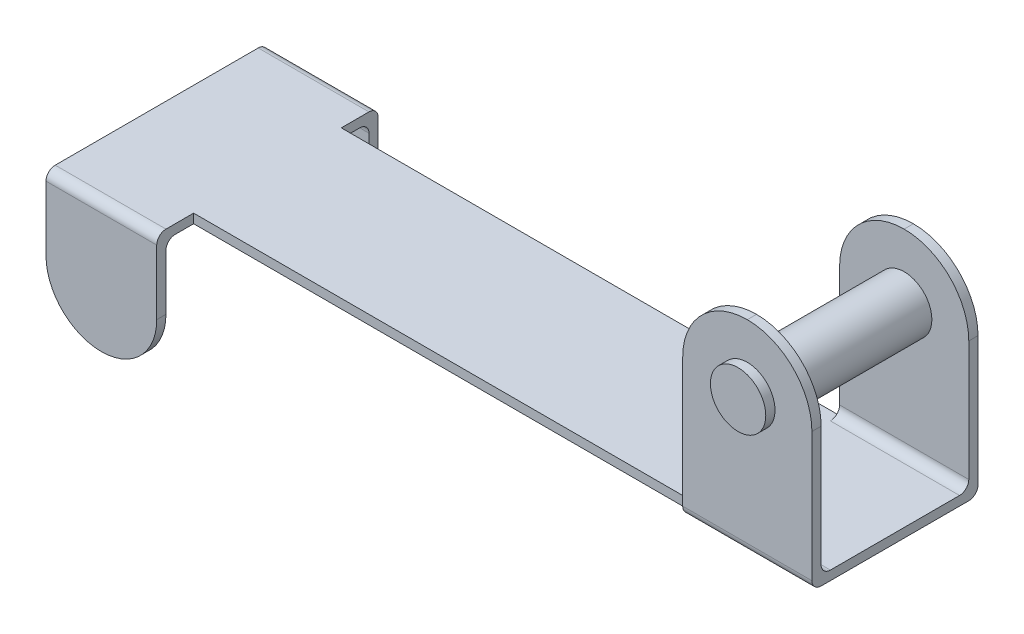
ISO-10303-21;
HEADER;
FILE_DESCRIPTION(('STEP AP214'),'2;1');
FILE_NAME('part.step','',(''),(''),'','','');
FILE_SCHEMA(('AUTOMOTIVE_DESIGN { 1 0 10303 214 1 1 1 1 }'));
ENDSEC;
DATA;
#1=APPLICATION_CONTEXT('core data for automotive mechanical design processes');
#2=APPLICATION_PROTOCOL_DEFINITION('international standard','automotive_design',2000,#1);
#3=PRODUCT_CONTEXT('',#1,'mechanical');
#4=PRODUCT('Part','Part','',(#3));
#5=PRODUCT_RELATED_PRODUCT_CATEGORY('part','',(#4));
#6=PRODUCT_DEFINITION_FORMATION('','',#4);
#7=PRODUCT_DEFINITION_CONTEXT('part definition',#1,'design');
#8=PRODUCT_DEFINITION('design','',#6,#7);
#9=PRODUCT_DEFINITION_SHAPE('','',#8);
#10=(LENGTH_UNIT() NAMED_UNIT(*) SI_UNIT(.MILLI.,.METRE.));
#11=(NAMED_UNIT(*) PLANE_ANGLE_UNIT() SI_UNIT($,.RADIAN.));
#12=(NAMED_UNIT(*) SI_UNIT($,.STERADIAN.) SOLID_ANGLE_UNIT());
#13=UNCERTAINTY_MEASURE_WITH_UNIT(LENGTH_MEASURE(1.E-05),#10,'distance_accuracy_value','');
#14=(GEOMETRIC_REPRESENTATION_CONTEXT(3) GLOBAL_UNCERTAINTY_ASSIGNED_CONTEXT((#13)) GLOBAL_UNIT_ASSIGNED_CONTEXT((#10,
#11,#12)) REPRESENTATION_CONTEXT('',''));
#15=CARTESIAN_POINT('',(0.,0.,0.));
#16=DIRECTION('',(0.,0.,1.));
#17=DIRECTION('',(1.,0.,0.));
#18=AXIS2_PLACEMENT_3D('',#15,#16,#17);
#19=CARTESIAN_POINT('',(0.,0.,2.));
#20=DIRECTION('',(0.,0.,1.));
#21=DIRECTION('',(1.,0.,0.));
#22=AXIS2_PLACEMENT_3D('',#19,#20,#21);
#23=PLANE('',#22);
#24=DIRECTION('',(-1.,0.,0.));
#25=VECTOR('',#24,1.);
#26=CARTESIAN_POINT('',(10.,0.125000000000001,2.));
#27=LINE('',#26,#25);
#28=CARTESIAN_POINT('',(6.5,0.125000000000001,2.));
#29=VERTEX_POINT('',#28);
#30=CARTESIAN_POINT('',(-7.,0.124999999999999,2.));
#31=VERTEX_POINT('',#30);
#32=EDGE_CURVE('E264',#29,#31,#27,.T.);
#33=ORIENTED_EDGE('',*,*,#32,.T.);
#34=DIRECTION('',(0.,-1.,0.));
#35=VECTOR('',#34,1.);
#36=CARTESIAN_POINT('',(-7.,0.124999999999999,2.));
#37=LINE('',#36,#35);
#38=CARTESIAN_POINT('',(-7.,-0.125000000000001,2.));
#39=VERTEX_POINT('',#38);
#40=EDGE_CURVE('E492',#31,#39,#37,.T.);
#41=ORIENTED_EDGE('',*,*,#40,.T.);
#42=DIRECTION('',(1.,0.,0.));
#43=VECTOR('',#42,1.);
#44=CARTESIAN_POINT('',(10.,-0.124999999999999,2.));
#45=LINE('',#44,#43);
#46=CARTESIAN_POINT('',(6.5,-0.124999999999999,2.));
#47=VERTEX_POINT('',#46);
#48=EDGE_CURVE('E262',#39,#47,#45,.T.);
#49=ORIENTED_EDGE('',*,*,#48,.T.);
#50=DIRECTION('',(0.,1.,0.));
#51=VECTOR('',#50,1.);
#52=CARTESIAN_POINT('',(6.5,-0.124999999999999,2.));
#53=LINE('',#52,#51);
#54=EDGE_CURVE('E480',#47,#29,#53,.T.);
#55=ORIENTED_EDGE('',*,*,#54,.T.);
#56=EDGE_LOOP('',(#33,#41,#49,#55));
#57=FACE_BOUND('',#56,.T.);
#58=ADVANCED_FACE('F32',(#57),#23,.T.);
#59=CARTESIAN_POINT('',(-10.,-0.125000000000001,2.));
#60=DIRECTION('',(1.,0.,0.));
#61=DIRECTION('',(0.,0.,-1.));
#62=AXIS2_PLACEMENT_3D('',#59,#60,#61);
#63=PLANE('',#62);
#64=DIRECTION('',(0.,1.,0.));
#65=VECTOR('',#64,1.);
#66=CARTESIAN_POINT('',(-10.,-3.375,3.));
#67=LINE('',#66,#65);
#68=CARTESIAN_POINT('',(-10.,-1.875,3.));
#69=VERTEX_POINT('',#68);
#70=CARTESIAN_POINT('',(-10.,-0.125000000000001,3.));
#71=VERTEX_POINT('',#70);
#72=EDGE_CURVE('E399',#69,#71,#67,.T.);
#73=ORIENTED_EDGE('',*,*,#72,.T.);
#74=CARTESIAN_POINT('',(-10.,-0.125000000000001,2.75));
#75=DIRECTION('',(1.,0.,0.));
#76=DIRECTION('',(0.,0.,-1.));
#77=AXIS2_PLACEMENT_3D('',#74,#75,#76);
#78=CIRCLE('',#77,0.25);
#79=CARTESIAN_POINT('',(-10.,0.124999999999999,2.75));
#80=VERTEX_POINT('',#79);
#81=EDGE_CURVE('E407',#71,#80,#78,.F.);
#82=ORIENTED_EDGE('',*,*,#81,.T.);
#83=DIRECTION('',(0.,0.,-1.));
#84=VECTOR('',#83,1.);
#85=CARTESIAN_POINT('',(-10.,0.124999999999999,2.));
#86=LINE('',#85,#84);
#87=CARTESIAN_POINT('',(-10.,0.124999999999999,-2.75));
#88=VERTEX_POINT('',#87);
#89=EDGE_CURVE('E270',#80,#88,#86,.T.);
#90=ORIENTED_EDGE('',*,*,#89,.T.);
#91=CARTESIAN_POINT('',(-10.,-0.125000000000001,-2.75));
#92=DIRECTION('',(1.,0.,0.));
#93=DIRECTION('',(0.,0.,-1.));
#94=AXIS2_PLACEMENT_3D('',#91,#92,#93);
#95=CIRCLE('',#94,0.25);
#96=CARTESIAN_POINT('',(-10.,-0.125000000000001,-3.));
#97=VERTEX_POINT('',#96);
#98=EDGE_CURVE('E405',#88,#97,#95,.F.);
#99=ORIENTED_EDGE('',*,*,#98,.T.);
#100=DIRECTION('',(0.,-1.,0.));
#101=VECTOR('',#100,1.);
#102=CARTESIAN_POINT('',(-10.,-3.375,-3.));
#103=LINE('',#102,#101);
#104=CARTESIAN_POINT('',(-10.,-1.875,-3.));
#105=VERTEX_POINT('',#104);
#106=EDGE_CURVE('E455',#97,#105,#103,.T.);
#107=ORIENTED_EDGE('',*,*,#106,.T.);
#108=DIRECTION('',(0.,0.,1.));
#109=VECTOR('',#108,1.);
#110=CARTESIAN_POINT('',(-10.,-1.875,-2.75));
#111=LINE('',#110,#109);
#112=CARTESIAN_POINT('',(-10.,-1.875,-2.75));
#113=VERTEX_POINT('',#112);
#114=EDGE_CURVE('E353',#105,#113,#111,.T.);
#115=ORIENTED_EDGE('',*,*,#114,.T.);
#116=DIRECTION('',(0.,1.,0.));
#117=VECTOR('',#116,1.);
#118=CARTESIAN_POINT('',(-10.,-0.124999999999999,-2.75));
#119=LINE('',#118,#117);
#120=CARTESIAN_POINT('',(-10.,-0.375000000000001,-2.75));
#121=VERTEX_POINT('',#120);
#122=EDGE_CURVE('E254',#113,#121,#119,.T.);
#123=ORIENTED_EDGE('',*,*,#122,.T.);
#124=CARTESIAN_POINT('',(-10.,-0.375000000000001,-2.5));
#125=DIRECTION('',(1.,0.,0.));
#126=DIRECTION('',(0.,0.,-1.));
#127=AXIS2_PLACEMENT_3D('',#124,#125,#126);
#128=CIRCLE('',#127,0.25);
#129=CARTESIAN_POINT('',(-10.,-0.125000000000001,-2.5));
#130=VERTEX_POINT('',#129);
#131=EDGE_CURVE('E40',#121,#130,#128,.T.);
#132=ORIENTED_EDGE('',*,*,#131,.T.);
#133=DIRECTION('',(0.,0.,-1.));
#134=VECTOR('',#133,1.);
#135=CARTESIAN_POINT('',(-10.,-0.125000000000001,2.));
#136=LINE('',#135,#134);
#137=CARTESIAN_POINT('',(-10.,-0.125000000000001,2.5));
#138=VERTEX_POINT('',#137);
#139=EDGE_CURVE('E279',#138,#130,#136,.T.);
#140=ORIENTED_EDGE('',*,*,#139,.F.);
#141=CARTESIAN_POINT('',(-10.,-0.375000000000001,2.5));
#142=DIRECTION('',(1.,0.,0.));
#143=DIRECTION('',(0.,0.,-1.));
#144=AXIS2_PLACEMENT_3D('',#141,#142,#143);
#145=CIRCLE('',#144,0.25);
#146=CARTESIAN_POINT('',(-10.,-0.375000000000001,2.75));
#147=VERTEX_POINT('',#146);
#148=EDGE_CURVE('E427',#138,#147,#145,.T.);
#149=ORIENTED_EDGE('',*,*,#148,.T.);
#150=DIRECTION('',(0.,-1.,0.));
#151=VECTOR('',#150,1.);
#152=CARTESIAN_POINT('',(-10.,-0.124999999999999,2.75));
#153=LINE('',#152,#151);
#154=CARTESIAN_POINT('',(-10.,-1.875,2.75));
#155=VERTEX_POINT('',#154);
#156=EDGE_CURVE('E510',#147,#155,#153,.T.);
#157=ORIENTED_EDGE('',*,*,#156,.T.);
#158=DIRECTION('',(0.,0.,1.));
#159=VECTOR('',#158,1.);
#160=CARTESIAN_POINT('',(-10.,-1.875,3.));
#161=LINE('',#160,#159);
#162=EDGE_CURVE('E368',#155,#69,#161,.T.);
#163=ORIENTED_EDGE('',*,*,#162,.T.);
#164=EDGE_LOOP('',(#73,#82,#90,#99,#107,#115,#123,#132,#140,#149,#157,#163));
#165=FACE_BOUND('',#164,.T.);
#166=ADVANCED_FACE('F434',(#165),#63,.F.);
#167=CARTESIAN_POINT('',(10.,-0.124999999999999,2.));
#168=DIRECTION('',(0.,1.,0.));
#169=DIRECTION('',(-1.,0.,0.));
#170=AXIS2_PLACEMENT_3D('',#167,#168,#169);
#171=PLANE('',#170);
#172=DIRECTION('',(0.,0.,1.));
#173=VECTOR('',#172,1.);
#174=CARTESIAN_POINT('',(-7.,-0.124999999999999,2.));
#175=LINE('',#174,#173);
#176=CARTESIAN_POINT('',(-7.,-0.124999999999999,2.5));
#177=VERTEX_POINT('',#176);
#178=EDGE_CURVE('E501',#39,#177,#175,.T.);
#179=ORIENTED_EDGE('',*,*,#178,.T.);
#180=DIRECTION('',(-1.,0.,0.));
#181=VECTOR('',#180,1.);
#182=CARTESIAN_POINT('',(10.,-0.124999999999999,2.5));
#183=LINE('',#182,#181);
#184=EDGE_CURVE('E417',#177,#138,#183,.T.);
#185=ORIENTED_EDGE('',*,*,#184,.T.);
#186=ORIENTED_EDGE('',*,*,#139,.T.);
#187=DIRECTION('',(-1.,0.,0.));
#188=VECTOR('',#187,1.);
#189=CARTESIAN_POINT('',(10.,-0.124999999999999,-2.5));
#190=LINE('',#189,#188);
#191=CARTESIAN_POINT('',(-7.,-0.124999999999999,-2.5));
#192=VERTEX_POINT('',#191);
#193=EDGE_CURVE('E415',#130,#192,#190,.F.);
#194=ORIENTED_EDGE('',*,*,#193,.T.);
#195=DIRECTION('',(0.,0.,1.));
#196=VECTOR('',#195,1.);
#197=CARTESIAN_POINT('',(-7.,-0.124999999999999,-2.));
#198=LINE('',#197,#196);
#199=CARTESIAN_POINT('',(-7.,-0.124999999999999,-2.));
#200=VERTEX_POINT('',#199);
#201=EDGE_CURVE('E449',#192,#200,#198,.T.);
#202=ORIENTED_EDGE('',*,*,#201,.T.);
#203=DIRECTION('',(1.,0.,0.));
#204=VECTOR('',#203,1.);
#205=CARTESIAN_POINT('',(10.,-0.124999999999999,-2.));
#206=LINE('',#205,#204);
#207=CARTESIAN_POINT('',(6.5,-0.124999999999999,-2.));
#208=VERTEX_POINT('',#207);
#209=EDGE_CURVE('E253',#200,#208,#206,.T.);
#210=ORIENTED_EDGE('',*,*,#209,.T.);
#211=DIRECTION('',(1.,0.,0.));
#212=VECTOR('',#211,1.);
#213=CARTESIAN_POINT('',(10.,-0.124999999999999,-2.));
#214=LINE('',#213,#212);
#215=CARTESIAN_POINT('',(10.,-0.124999999999999,-2.));
#216=VERTEX_POINT('',#215);
#217=EDGE_CURVE('E286',#208,#216,#214,.T.);
#218=ORIENTED_EDGE('',*,*,#217,.T.);
#219=DIRECTION('',(0.,0.,-1.));
#220=VECTOR('',#219,1.);
#221=CARTESIAN_POINT('',(10.,-0.124999999999999,2.));
#222=LINE('',#221,#220);
#223=CARTESIAN_POINT('',(10.,-0.124999999999999,2.));
#224=VERTEX_POINT('',#223);
#225=EDGE_CURVE('E276',#224,#216,#222,.T.);
#226=ORIENTED_EDGE('',*,*,#225,.F.);
#227=DIRECTION('',(1.,0.,0.));
#228=VECTOR('',#227,1.);
#229=CARTESIAN_POINT('',(6.5,-0.124999999999999,2.));
#230=LINE('',#229,#228);
#231=EDGE_CURVE('E283',#224,#47,#230,.F.);
#232=ORIENTED_EDGE('',*,*,#231,.T.);
#233=ORIENTED_EDGE('',*,*,#48,.F.);
#234=EDGE_LOOP('',(#179,#185,#186,#194,#202,#210,#218,#226,#232,#233));
#235=FACE_BOUND('',#234,.T.);
#236=ADVANCED_FACE('F441',(#235),#171,.F.);
#237=CARTESIAN_POINT('',(10.,-0.124999999999999,2.));
#238=DIRECTION('',(-1.,0.,0.));
#239=DIRECTION('',(0.,0.,1.));
#240=AXIS2_PLACEMENT_3D('',#237,#238,#239);
#241=PLANE('',#240);
#242=DIRECTION('',(0.,1.,0.));
#243=VECTOR('',#242,1.);
#244=CARTESIAN_POINT('',(10.,-0.124999999999998,-2.25));
#245=LINE('',#244,#243);
#246=CARTESIAN_POINT('',(10.,0.125000000000001,-2.25));
#247=VERTEX_POINT('',#246);
#248=CARTESIAN_POINT('',(10.,3.625,-2.25));
#249=VERTEX_POINT('',#248);
#250=EDGE_CURVE('E473',#247,#249,#245,.T.);
#251=ORIENTED_EDGE('',*,*,#250,.T.);
#252=DIRECTION('',(0.,0.,1.));
#253=VECTOR('',#252,1.);
#254=CARTESIAN_POINT('',(10.,3.625,-2.));
#255=LINE('',#254,#253);
#256=CARTESIAN_POINT('',(10.,3.625,-2.));
#257=VERTEX_POINT('',#256);
#258=EDGE_CURVE('E329',#249,#257,#255,.T.);
#259=ORIENTED_EDGE('',*,*,#258,.T.);
#260=DIRECTION('',(0.,-1.,0.));
#261=VECTOR('',#260,1.);
#262=CARTESIAN_POINT('',(10.,-0.124999999999999,-2.));
#263=LINE('',#262,#261);
#264=CARTESIAN_POINT('',(10.,0.375000000000001,-2.));
#265=VERTEX_POINT('',#264);
#266=EDGE_CURVE('E357',#257,#265,#263,.T.);
#267=ORIENTED_EDGE('',*,*,#266,.T.);
#268=CARTESIAN_POINT('',(10.,0.375000000000001,-1.75));
#269=DIRECTION('',(-1.,0.,0.));
#270=DIRECTION('',(0.,0.,1.));
#271=AXIS2_PLACEMENT_3D('',#268,#269,#270);
#272=CIRCLE('',#271,0.25);
#273=CARTESIAN_POINT('',(10.,0.125000000000001,-1.75));
#274=VERTEX_POINT('',#273);
#275=EDGE_CURVE('E321',#265,#274,#272,.T.);
#276=ORIENTED_EDGE('',*,*,#275,.T.);
#277=DIRECTION('',(0.,0.,-1.));
#278=VECTOR('',#277,1.);
#279=CARTESIAN_POINT('',(10.,0.125000000000001,2.));
#280=LINE('',#279,#278);
#281=CARTESIAN_POINT('',(10.,0.125000000000001,1.75));
#282=VERTEX_POINT('',#281);
#283=EDGE_CURVE('E273',#282,#274,#280,.T.);
#284=ORIENTED_EDGE('',*,*,#283,.F.);
#285=CARTESIAN_POINT('',(10.,0.375000000000001,1.75));
#286=DIRECTION('',(-1.,0.,0.));
#287=DIRECTION('',(0.,0.,1.));
#288=AXIS2_PLACEMENT_3D('',#285,#286,#287);
#289=CIRCLE('',#288,0.25);
#290=CARTESIAN_POINT('',(10.,0.375000000000001,2.));
#291=VERTEX_POINT('',#290);
#292=EDGE_CURVE('E325',#282,#291,#289,.T.);
#293=ORIENTED_EDGE('',*,*,#292,.T.);
#294=DIRECTION('',(0.,1.,0.));
#295=VECTOR('',#294,1.);
#296=CARTESIAN_POINT('',(10.,-0.124999999999999,2.));
#297=LINE('',#296,#295);
#298=CARTESIAN_POINT('',(10.,3.625,2.));
#299=VERTEX_POINT('',#298);
#300=EDGE_CURVE('E476',#291,#299,#297,.T.);
#301=ORIENTED_EDGE('',*,*,#300,.T.);
#302=DIRECTION('',(0.,0.,1.));
#303=VECTOR('',#302,1.);
#304=CARTESIAN_POINT('',(10.,3.625,2.25));
#305=LINE('',#304,#303);
#306=CARTESIAN_POINT('',(10.,3.625,2.25));
#307=VERTEX_POINT('',#306);
#308=EDGE_CURVE('E327',#299,#307,#305,.T.);
#309=ORIENTED_EDGE('',*,*,#308,.T.);
#310=DIRECTION('',(0.,-1.,0.));
#311=VECTOR('',#310,1.);
#312=CARTESIAN_POINT('',(10.,-0.124999999999999,2.25));
#313=LINE('',#312,#311);
#314=CARTESIAN_POINT('',(10.,0.125000000000001,2.25));
#315=VERTEX_POINT('',#314);
#316=EDGE_CURVE('E487',#307,#315,#313,.T.);
#317=ORIENTED_EDGE('',*,*,#316,.T.);
#318=CARTESIAN_POINT('',(10.,0.125000000000001,2.));
#319=DIRECTION('',(-1.,0.,0.));
#320=DIRECTION('',(0.,0.,1.));
#321=AXIS2_PLACEMENT_3D('',#318,#319,#320);
#322=CIRCLE('',#321,0.25);
#323=EDGE_CURVE('E289',#315,#224,#322,.F.);
#324=ORIENTED_EDGE('',*,*,#323,.T.);
#325=ORIENTED_EDGE('',*,*,#225,.T.);
#326=CARTESIAN_POINT('',(10.,0.125000000000001,-2.));
#327=DIRECTION('',(-1.,0.,0.));
#328=DIRECTION('',(0.,0.,1.));
#329=AXIS2_PLACEMENT_3D('',#326,#327,#328);
#330=CIRCLE('',#329,0.25);
#331=EDGE_CURVE('E291',#216,#247,#330,.F.);
#332=ORIENTED_EDGE('',*,*,#331,.T.);
#333=EDGE_LOOP('',(#251,#259,#267,#276,#284,#293,#301,#309,#317,#324,#325,#332));
#334=FACE_BOUND('',#333,.T.);
#335=ADVANCED_FACE('F559',(#334),#241,.F.);
#336=CARTESIAN_POINT('',(10.,0.125000000000001,2.));
#337=DIRECTION('',(0.,-1.,0.));
#338=DIRECTION('',(1.,0.,0.));
#339=AXIS2_PLACEMENT_3D('',#336,#337,#338);
#340=PLANE('',#339);
#341=ORIENTED_EDGE('',*,*,#89,.F.);
#342=DIRECTION('',(-1.,0.,0.));
#343=VECTOR('',#342,1.);
#344=CARTESIAN_POINT('',(-7.,0.124999999999999,2.75));
#345=LINE('',#344,#343);
#346=CARTESIAN_POINT('',(-7.,0.124999999999999,2.75));
#347=VERTEX_POINT('',#346);
#348=EDGE_CURVE('E411',#80,#347,#345,.F.);
#349=ORIENTED_EDGE('',*,*,#348,.T.);
#350=DIRECTION('',(0.,0.,-1.));
#351=VECTOR('',#350,1.);
#352=CARTESIAN_POINT('',(-7.,0.124999999999999,3.));
#353=LINE('',#352,#351);
#354=EDGE_CURVE('E499',#347,#31,#353,.T.);
#355=ORIENTED_EDGE('',*,*,#354,.T.);
#356=ORIENTED_EDGE('',*,*,#32,.F.);
#357=DIRECTION('',(0.,0.,-1.));
#358=VECTOR('',#357,1.);
#359=CARTESIAN_POINT('',(6.5,0.125000000000001,0.));
#360=LINE('',#359,#358);
#361=CARTESIAN_POINT('',(6.5,0.125000000000001,1.75));
#362=VERTEX_POINT('',#361);
#363=EDGE_CURVE('E306',#29,#362,#360,.T.);
#364=ORIENTED_EDGE('',*,*,#363,.T.);
#365=DIRECTION('',(-1.,0.,0.));
#366=VECTOR('',#365,1.);
#367=CARTESIAN_POINT('',(10.,0.125000000000001,1.75));
#368=LINE('',#367,#366);
#369=EDGE_CURVE('E304',#362,#282,#368,.F.);
#370=ORIENTED_EDGE('',*,*,#369,.T.);
#371=ORIENTED_EDGE('',*,*,#283,.T.);
#372=DIRECTION('',(-1.,0.,0.));
#373=VECTOR('',#372,1.);
#374=CARTESIAN_POINT('',(10.,0.125000000000001,-1.75));
#375=LINE('',#374,#373);
#376=CARTESIAN_POINT('',(6.5,0.125000000000001,-1.75));
#377=VERTEX_POINT('',#376);
#378=EDGE_CURVE('E310',#274,#377,#375,.T.);
#379=ORIENTED_EDGE('',*,*,#378,.T.);
#380=DIRECTION('',(0.,0.,-1.));
#381=VECTOR('',#380,1.);
#382=CARTESIAN_POINT('',(6.5,0.125000000000001,2.));
#383=LINE('',#382,#381);
#384=CARTESIAN_POINT('',(6.5,0.125,-2.));
#385=VERTEX_POINT('',#384);
#386=EDGE_CURVE('E260',#377,#385,#383,.T.);
#387=ORIENTED_EDGE('',*,*,#386,.T.);
#388=DIRECTION('',(-1.,0.,0.));
#389=VECTOR('',#388,1.);
#390=CARTESIAN_POINT('',(10.,0.125000000000001,-2.));
#391=LINE('',#390,#389);
#392=CARTESIAN_POINT('',(-7.,0.124999999999999,-2.));
#393=VERTEX_POINT('',#392);
#394=EDGE_CURVE('E252',#385,#393,#391,.T.);
#395=ORIENTED_EDGE('',*,*,#394,.T.);
#396=DIRECTION('',(0.,0.,-1.));
#397=VECTOR('',#396,1.);
#398=CARTESIAN_POINT('',(-7.,0.124999999999999,-3.));
#399=LINE('',#398,#397);
#400=CARTESIAN_POINT('',(-7.,0.124999999999999,-2.75));
#401=VERTEX_POINT('',#400);
#402=EDGE_CURVE('E235',#393,#401,#399,.T.);
#403=ORIENTED_EDGE('',*,*,#402,.T.);
#404=DIRECTION('',(-1.,0.,0.));
#405=VECTOR('',#404,1.);
#406=CARTESIAN_POINT('',(-10.,0.124999999999999,-2.75));
#407=LINE('',#406,#405);
#408=EDGE_CURVE('E409',#401,#88,#407,.T.);
#409=ORIENTED_EDGE('',*,*,#408,.T.);
#410=EDGE_LOOP('',(#341,#349,#355,#356,#364,#370,#371,#379,#387,#395,#403,#409));
#411=FACE_BOUND('',#410,.T.);
#412=ADVANCED_FACE('F257',(#411),#340,.F.);
#413=CARTESIAN_POINT('',(0.,0.,-2.));
#414=DIRECTION('',(0.,0.,1.));
#415=DIRECTION('',(1.,0.,0.));
#416=AXIS2_PLACEMENT_3D('',#413,#414,#415);
#417=PLANE('',#416);
#418=ORIENTED_EDGE('',*,*,#209,.F.);
#419=DIRECTION('',(0.,1.,0.));
#420=VECTOR('',#419,1.);
#421=CARTESIAN_POINT('',(-7.,0.124999999999999,-2.));
#422=LINE('',#421,#420);
#423=EDGE_CURVE('E238',#200,#393,#422,.T.);
#424=ORIENTED_EDGE('',*,*,#423,.T.);
#425=ORIENTED_EDGE('',*,*,#394,.F.);
#426=DIRECTION('',(0.,-1.,0.));
#427=VECTOR('',#426,1.);
#428=CARTESIAN_POINT('',(6.5,-0.124999999999999,-2.));
#429=LINE('',#428,#427);
#430=EDGE_CURVE('E282',#385,#208,#429,.T.);
#431=ORIENTED_EDGE('',*,*,#430,.T.);
#432=EDGE_LOOP('',(#418,#424,#425,#431));
#433=FACE_BOUND('',#432,.T.);
#434=ADVANCED_FACE('F250',(#433),#417,.F.);
#435=CARTESIAN_POINT('',(6.5,-0.124999999999999,2.));
#436=DIRECTION('',(0.,0.,-1.));
#437=DIRECTION('',(-1.,0.,0.));
#438=AXIS2_PLACEMENT_3D('',#435,#436,#437);
#439=PLANE('',#438);
#440=CARTESIAN_POINT('',(8.25,3.625,2.));
#441=DIRECTION('',(0.,0.,-1.));
#442=DIRECTION('',(-1.,0.,0.));
#443=AXIS2_PLACEMENT_3D('',#440,#441,#442);
#444=CIRCLE('',#443,0.75);
#445=CARTESIAN_POINT('',(7.5,3.625,2.));
#446=VERTEX_POINT('',#445);
#447=EDGE_CURVE('E361',#446,#446,#444,.F.);
#448=ORIENTED_EDGE('',*,*,#447,.T.);
#449=EDGE_LOOP('',(#448));
#450=FACE_BOUND('',#449,.T.);
#451=CARTESIAN_POINT('',(6.5,0.375000000000001,2.));
#452=VERTEX_POINT('',#451);
#453=CARTESIAN_POINT('',(6.5,3.625,2.));
#454=VERTEX_POINT('',#453);
#455=EDGE_CURVE('E483',#452,#454,#53,.T.);
#456=ORIENTED_EDGE('',*,*,#455,.T.);
#457=CARTESIAN_POINT('',(8.25,3.625,2.));
#458=DIRECTION('',(0.,0.,-1.));
#459=DIRECTION('',(-1.,0.,0.));
#460=AXIS2_PLACEMENT_3D('',#457,#458,#459);
#461=CIRCLE('',#460,1.75);
#462=CARTESIAN_POINT('',(8.25,5.375,2.));
#463=VERTEX_POINT('',#462);
#464=EDGE_CURVE('E351',#454,#463,#461,.T.);
#465=ORIENTED_EDGE('',*,*,#464,.T.);
#466=CARTESIAN_POINT('',(8.25,3.625,2.));
#467=DIRECTION('',(0.,0.,-1.));
#468=DIRECTION('',(-1.,0.,0.));
#469=AXIS2_PLACEMENT_3D('',#466,#467,#468);
#470=CIRCLE('',#469,1.75);
#471=EDGE_CURVE('E349',#463,#299,#470,.T.);
#472=ORIENTED_EDGE('',*,*,#471,.T.);
#473=ORIENTED_EDGE('',*,*,#300,.F.);
#474=DIRECTION('',(-1.,0.,0.));
#475=VECTOR('',#474,1.);
#476=CARTESIAN_POINT('',(6.5,0.375000000000001,2.));
#477=LINE('',#476,#475);
#478=EDGE_CURVE('E315',#291,#452,#477,.T.);
#479=ORIENTED_EDGE('',*,*,#478,.T.);
#480=EDGE_LOOP('',(#456,#465,#472,#473,#479));
#481=FACE_BOUND('',#480,.T.);
#482=ADVANCED_FACE('F553',(#450,#481),#439,.T.);
#483=CARTESIAN_POINT('',(6.5,-0.124999999999999,2.25));
#484=DIRECTION('',(0.,0.,1.));
#485=DIRECTION('',(1.,0.,0.));
#486=AXIS2_PLACEMENT_3D('',#483,#484,#485);
#487=PLANE('',#486);
#488=CARTESIAN_POINT('',(8.25,3.625,2.25));
#489=DIRECTION('',(0.,0.,1.));
#490=DIRECTION('',(1.,0.,0.));
#491=AXIS2_PLACEMENT_3D('',#488,#489,#490);
#492=CIRCLE('',#491,0.75);
#493=CARTESIAN_POINT('',(9.,3.625,2.25));
#494=VERTEX_POINT('',#493);
#495=EDGE_CURVE('E465',#494,#494,#492,.F.);
#496=ORIENTED_EDGE('',*,*,#495,.T.);
#497=EDGE_LOOP('',(#496));
#498=FACE_BOUND('',#497,.T.);
#499=CARTESIAN_POINT('',(8.25,3.625,2.25));
#500=DIRECTION('',(0.,0.,1.));
#501=DIRECTION('',(1.,0.,0.));
#502=AXIS2_PLACEMENT_3D('',#499,#500,#501);
#503=CIRCLE('',#502,1.75);
#504=CARTESIAN_POINT('',(8.25,5.375,2.25));
#505=VERTEX_POINT('',#504);
#506=EDGE_CURVE('E342',#307,#505,#503,.T.);
#507=ORIENTED_EDGE('',*,*,#506,.T.);
#508=CARTESIAN_POINT('',(8.25,3.625,2.25));
#509=DIRECTION('',(0.,0.,1.));
#510=DIRECTION('',(1.,0.,0.));
#511=AXIS2_PLACEMENT_3D('',#508,#509,#510);
#512=CIRCLE('',#511,1.75);
#513=CARTESIAN_POINT('',(6.5,3.625,2.25));
#514=VERTEX_POINT('',#513);
#515=EDGE_CURVE('E344',#505,#514,#512,.T.);
#516=ORIENTED_EDGE('',*,*,#515,.T.);
#517=DIRECTION('',(0.,-1.,0.));
#518=VECTOR('',#517,1.);
#519=CARTESIAN_POINT('',(6.5,-0.124999999999999,2.25));
#520=LINE('',#519,#518);
#521=CARTESIAN_POINT('',(6.5,0.125000000000001,2.25));
#522=VERTEX_POINT('',#521);
#523=EDGE_CURVE('E266',#514,#522,#520,.T.);
#524=ORIENTED_EDGE('',*,*,#523,.T.);
#525=DIRECTION('',(1.,0.,0.));
#526=VECTOR('',#525,1.);
#527=CARTESIAN_POINT('',(10.,0.125000000000001,2.25));
#528=LINE('',#527,#526);
#529=EDGE_CURVE('E298',#522,#315,#528,.T.);
#530=ORIENTED_EDGE('',*,*,#529,.T.);
#531=ORIENTED_EDGE('',*,*,#316,.F.);
#532=EDGE_LOOP('',(#507,#516,#524,#530,#531));
#533=FACE_BOUND('',#532,.T.);
#534=ADVANCED_FACE('F820',(#498,#533),#487,.T.);
#535=CARTESIAN_POINT('',(6.5,0.,0.));
#536=DIRECTION('',(1.,0.,0.));
#537=DIRECTION('',(0.,0.,-1.));
#538=AXIS2_PLACEMENT_3D('',#535,#536,#537);
#539=PLANE('',#538);
#540=ORIENTED_EDGE('',*,*,#523,.F.);
#541=DIRECTION('',(0.,0.,1.));
#542=VECTOR('',#541,1.);
#543=CARTESIAN_POINT('',(6.5,3.625,2.));
#544=LINE('',#543,#542);
#545=EDGE_CURVE('E346',#514,#454,#544,.F.);
#546=ORIENTED_EDGE('',*,*,#545,.T.);
#547=ORIENTED_EDGE('',*,*,#455,.F.);
#548=CARTESIAN_POINT('',(6.5,0.375000000000001,1.75));
#549=DIRECTION('',(1.,0.,0.));
#550=DIRECTION('',(0.,0.,-1.));
#551=AXIS2_PLACEMENT_3D('',#548,#549,#550);
#552=CIRCLE('',#551,0.25);
#553=EDGE_CURVE('E323',#452,#362,#552,.T.);
#554=ORIENTED_EDGE('',*,*,#553,.T.);
#555=ORIENTED_EDGE('',*,*,#363,.F.);
#556=ORIENTED_EDGE('',*,*,#54,.F.);
#557=CARTESIAN_POINT('',(6.5,0.125000000000001,2.));
#558=DIRECTION('',(1.,0.,0.));
#559=DIRECTION('',(0.,0.,-1.));
#560=AXIS2_PLACEMENT_3D('',#557,#558,#559);
#561=CIRCLE('',#560,0.25);
#562=EDGE_CURVE('E301',#47,#522,#561,.F.);
#563=ORIENTED_EDGE('',*,*,#562,.T.);
#564=EDGE_LOOP('',(#540,#546,#547,#554,#555,#556,#563));
#565=FACE_BOUND('',#564,.T.);
#566=ADVANCED_FACE('F812',(#565),#539,.F.);
#567=CARTESIAN_POINT('',(6.5,-0.124999999999999,-2.));
#568=DIRECTION('',(0.,0.,1.));
#569=DIRECTION('',(1.,0.,0.));
#570=AXIS2_PLACEMENT_3D('',#567,#568,#569);
#571=PLANE('',#570);
#572=CARTESIAN_POINT('',(8.25,3.625,-2.));
#573=DIRECTION('',(0.,0.,1.));
#574=DIRECTION('',(1.,0.,0.));
#575=AXIS2_PLACEMENT_3D('',#572,#573,#574);
#576=CIRCLE('',#575,0.75);
#577=CARTESIAN_POINT('',(9.,3.625,-2.));
#578=VERTEX_POINT('',#577);
#579=EDGE_CURVE('E365',#578,#578,#576,.F.);
#580=ORIENTED_EDGE('',*,*,#579,.T.);
#581=EDGE_LOOP('',(#580));
#582=FACE_BOUND('',#581,.T.);
#583=ORIENTED_EDGE('',*,*,#266,.F.);
#584=CARTESIAN_POINT('',(8.25,3.625,-2.));
#585=DIRECTION('',(0.,0.,1.));
#586=DIRECTION('',(1.,0.,0.));
#587=AXIS2_PLACEMENT_3D('',#584,#585,#586);
#588=CIRCLE('',#587,1.75);
#589=CARTESIAN_POINT('',(8.25,5.375,-2.));
#590=VERTEX_POINT('',#589);
#591=EDGE_CURVE('E334',#257,#590,#588,.T.);
#592=ORIENTED_EDGE('',*,*,#591,.T.);
#593=CARTESIAN_POINT('',(8.25,3.625,-2.));
#594=DIRECTION('',(0.,0.,1.));
#595=DIRECTION('',(1.,0.,0.));
#596=AXIS2_PLACEMENT_3D('',#593,#594,#595);
#597=CIRCLE('',#596,1.75);
#598=CARTESIAN_POINT('',(6.5,3.625,-2.));
#599=VERTEX_POINT('',#598);
#600=EDGE_CURVE('E332',#590,#599,#597,.T.);
#601=ORIENTED_EDGE('',*,*,#600,.T.);
#602=CARTESIAN_POINT('',(6.5,0.375000000000001,-2.));
#603=VERTEX_POINT('',#602);
#604=EDGE_CURVE('E470',#599,#603,#429,.T.);
#605=ORIENTED_EDGE('',*,*,#604,.T.);
#606=DIRECTION('',(-1.,0.,0.));
#607=VECTOR('',#606,1.);
#608=CARTESIAN_POINT('',(6.5,0.375000000000001,-2.));
#609=LINE('',#608,#607);
#610=EDGE_CURVE('E312',#603,#265,#609,.F.);
#611=ORIENTED_EDGE('',*,*,#610,.T.);
#612=EDGE_LOOP('',(#583,#592,#601,#605,#611));
#613=FACE_BOUND('',#612,.T.);
#614=ADVANCED_FACE('F800',(#582,#613),#571,.T.);
#615=CARTESIAN_POINT('',(6.5,-0.124999999999998,-2.25));
#616=DIRECTION('',(0.,0.,-1.));
#617=DIRECTION('',(-1.,0.,0.));
#618=AXIS2_PLACEMENT_3D('',#615,#616,#617);
#619=PLANE('',#618);
#620=CARTESIAN_POINT('',(8.25,3.625,-2.25));
#621=DIRECTION('',(0.,0.,-1.));
#622=DIRECTION('',(-1.,0.,0.));
#623=AXIS2_PLACEMENT_3D('',#620,#621,#622);
#624=CIRCLE('',#623,0.75);
#625=CARTESIAN_POINT('',(7.5,3.625,-2.25));
#626=VERTEX_POINT('',#625);
#627=EDGE_CURVE('E362',#626,#626,#624,.F.);
#628=ORIENTED_EDGE('',*,*,#627,.T.);
#629=EDGE_LOOP('',(#628));
#630=FACE_BOUND('',#629,.T.);
#631=CARTESIAN_POINT('',(8.25,3.625,-2.25));
#632=DIRECTION('',(0.,0.,-1.));
#633=DIRECTION('',(-1.,0.,0.));
#634=AXIS2_PLACEMENT_3D('',#631,#632,#633);
#635=CIRCLE('',#634,1.75);
#636=CARTESIAN_POINT('',(6.5,3.625,-2.25));
#637=VERTEX_POINT('',#636);
#638=CARTESIAN_POINT('',(8.25,5.375,-2.25));
#639=VERTEX_POINT('',#638);
#640=EDGE_CURVE('E336',#637,#639,#635,.T.);
#641=ORIENTED_EDGE('',*,*,#640,.T.);
#642=CARTESIAN_POINT('',(8.25,3.625,-2.25));
#643=DIRECTION('',(0.,0.,-1.));
#644=DIRECTION('',(-1.,0.,0.));
#645=AXIS2_PLACEMENT_3D('',#642,#643,#644);
#646=CIRCLE('',#645,1.75);
#647=EDGE_CURVE('E338',#639,#249,#646,.T.);
#648=ORIENTED_EDGE('',*,*,#647,.T.);
#649=ORIENTED_EDGE('',*,*,#250,.F.);
#650=DIRECTION('',(1.,0.,0.));
#651=VECTOR('',#650,1.);
#652=CARTESIAN_POINT('',(6.5,0.125000000000001,-2.25));
#653=LINE('',#652,#651);
#654=CARTESIAN_POINT('',(6.5,0.125000000000001,-2.25));
#655=VERTEX_POINT('',#654);
#656=EDGE_CURVE('E293',#247,#655,#653,.F.);
#657=ORIENTED_EDGE('',*,*,#656,.T.);
#658=DIRECTION('',(0.,1.,0.));
#659=VECTOR('',#658,1.);
#660=CARTESIAN_POINT('',(6.5,-0.124999999999998,-2.25));
#661=LINE('',#660,#659);
#662=EDGE_CURVE('E472',#655,#637,#661,.T.);
#663=ORIENTED_EDGE('',*,*,#662,.T.);
#664=EDGE_LOOP('',(#641,#648,#649,#657,#663));
#665=FACE_BOUND('',#664,.T.);
#666=ADVANCED_FACE('F795',(#630,#665),#619,.T.);
#667=CARTESIAN_POINT('',(6.5,0.,0.));
#668=DIRECTION('',(-1.,0.,0.));
#669=DIRECTION('',(0.,0.,1.));
#670=AXIS2_PLACEMENT_3D('',#667,#668,#669);
#671=PLANE('',#670);
#672=ORIENTED_EDGE('',*,*,#604,.F.);
#673=DIRECTION('',(0.,0.,1.));
#674=VECTOR('',#673,1.);
#675=CARTESIAN_POINT('',(6.5,3.625,0.));
#676=LINE('',#675,#674);
#677=EDGE_CURVE('E340',#599,#637,#676,.F.);
#678=ORIENTED_EDGE('',*,*,#677,.T.);
#679=ORIENTED_EDGE('',*,*,#662,.F.);
#680=CARTESIAN_POINT('',(6.5,0.125000000000001,-2.));
#681=DIRECTION('',(-1.,0.,0.));
#682=DIRECTION('',(0.,0.,1.));
#683=AXIS2_PLACEMENT_3D('',#680,#681,#682);
#684=CIRCLE('',#683,0.25);
#685=EDGE_CURVE('E295',#655,#208,#684,.T.);
#686=ORIENTED_EDGE('',*,*,#685,.T.);
#687=ORIENTED_EDGE('',*,*,#430,.F.);
#688=ORIENTED_EDGE('',*,*,#386,.F.);
#689=CARTESIAN_POINT('',(6.5,0.375000000000001,-1.75));
#690=DIRECTION('',(-1.,0.,0.));
#691=DIRECTION('',(0.,0.,1.));
#692=AXIS2_PLACEMENT_3D('',#689,#690,#691);
#693=CIRCLE('',#692,0.25);
#694=EDGE_CURVE('E318',#377,#603,#693,.F.);
#695=ORIENTED_EDGE('',*,*,#694,.T.);
#696=EDGE_LOOP('',(#672,#678,#679,#686,#687,#688,#695));
#697=FACE_BOUND('',#696,.T.);
#698=ADVANCED_FACE('F569',(#697),#671,.T.);
#699=CARTESIAN_POINT('',(10.,0.125000000000001,-2.));
#700=DIRECTION('',(-1.,0.,0.));
#701=DIRECTION('',(0.,-1.,0.));
#702=AXIS2_PLACEMENT_3D('',#699,#700,#701);
#703=CYLINDRICAL_SURFACE('',#702,0.25);
#704=ORIENTED_EDGE('',*,*,#685,.F.);
#705=ORIENTED_EDGE('',*,*,#656,.F.);
#706=ORIENTED_EDGE('',*,*,#331,.F.);
#707=ORIENTED_EDGE('',*,*,#217,.F.);
#708=EDGE_LOOP('',(#704,#705,#706,#707));
#709=FACE_BOUND('',#708,.T.);
#710=ADVANCED_FACE('F565',(#709),#703,.T.);
#711=CARTESIAN_POINT('',(6.5,0.125000000000001,2.));
#712=DIRECTION('',(-1.,0.,0.));
#713=DIRECTION('',(0.,-1.,0.));
#714=AXIS2_PLACEMENT_3D('',#711,#712,#713);
#715=CYLINDRICAL_SURFACE('',#714,0.25);
#716=ORIENTED_EDGE('',*,*,#562,.F.);
#717=ORIENTED_EDGE('',*,*,#231,.F.);
#718=ORIENTED_EDGE('',*,*,#323,.F.);
#719=ORIENTED_EDGE('',*,*,#529,.F.);
#720=EDGE_LOOP('',(#716,#717,#718,#719));
#721=FACE_BOUND('',#720,.T.);
#722=ADVANCED_FACE('F568',(#721),#715,.T.);
#723=CARTESIAN_POINT('',(10.,0.375000000000001,-1.75));
#724=DIRECTION('',(-1.,0.,0.));
#725=DIRECTION('',(0.,-1.,0.));
#726=AXIS2_PLACEMENT_3D('',#723,#724,#725);
#727=CYLINDRICAL_SURFACE('',#726,0.25);
#728=ORIENTED_EDGE('',*,*,#275,.F.);
#729=ORIENTED_EDGE('',*,*,#610,.F.);
#730=ORIENTED_EDGE('',*,*,#694,.F.);
#731=ORIENTED_EDGE('',*,*,#378,.F.);
#732=EDGE_LOOP('',(#728,#729,#730,#731));
#733=FACE_BOUND('',#732,.T.);
#734=ADVANCED_FACE('F573',(#733),#727,.F.);
#735=CARTESIAN_POINT('',(6.5,0.375000000000001,1.75));
#736=DIRECTION('',(-1.,0.,0.));
#737=DIRECTION('',(0.,-1.,0.));
#738=AXIS2_PLACEMENT_3D('',#735,#736,#737);
#739=CYLINDRICAL_SURFACE('',#738,0.25);
#740=ORIENTED_EDGE('',*,*,#292,.F.);
#741=ORIENTED_EDGE('',*,*,#369,.F.);
#742=ORIENTED_EDGE('',*,*,#553,.F.);
#743=ORIENTED_EDGE('',*,*,#478,.F.);
#744=EDGE_LOOP('',(#740,#741,#742,#743));
#745=FACE_BOUND('',#744,.T.);
#746=ADVANCED_FACE('F577',(#745),#739,.F.);
#747=CARTESIAN_POINT('',(8.25,3.625,-2.));
#748=DIRECTION('',(0.,0.,1.));
#749=DIRECTION('',(1.,0.,0.));
#750=AXIS2_PLACEMENT_3D('',#747,#748,#749);
#751=CYLINDRICAL_SURFACE('',#750,1.75);
#752=DIRECTION('',(0.,0.,1.));
#753=VECTOR('',#752,1.);
#754=CARTESIAN_POINT('',(8.25,5.375,-2.));
#755=LINE('',#754,#753);
#756=EDGE_CURVE('E354',#639,#590,#755,.T.);
#757=ORIENTED_EDGE('',*,*,#756,.F.);
#758=ORIENTED_EDGE('',*,*,#640,.F.);
#759=ORIENTED_EDGE('',*,*,#677,.F.);
#760=ORIENTED_EDGE('',*,*,#600,.F.);
#761=EDGE_LOOP('',(#757,#758,#759,#760));
#762=FACE_BOUND('',#761,.T.);
#763=ADVANCED_FACE('F581',(#762),#751,.T.);
#764=CARTESIAN_POINT('',(8.25,3.625,2.));
#765=DIRECTION('',(0.,0.,-1.));
#766=DIRECTION('',(-1.,0.,0.));
#767=AXIS2_PLACEMENT_3D('',#764,#765,#766);
#768=CYLINDRICAL_SURFACE('',#767,1.75);
#769=ORIENTED_EDGE('',*,*,#647,.F.);
#770=ORIENTED_EDGE('',*,*,#756,.T.);
#771=ORIENTED_EDGE('',*,*,#591,.F.);
#772=ORIENTED_EDGE('',*,*,#258,.F.);
#773=EDGE_LOOP('',(#769,#770,#771,#772));
#774=FACE_BOUND('',#773,.T.);
#775=ADVANCED_FACE('F583',(#774),#768,.T.);
#776=CARTESIAN_POINT('',(8.25,3.625,2.));
#777=DIRECTION('',(0.,0.,-1.));
#778=DIRECTION('',(-1.,0.,0.));
#779=AXIS2_PLACEMENT_3D('',#776,#777,#778);
#780=CYLINDRICAL_SURFACE('',#779,1.75);
#781=ORIENTED_EDGE('',*,*,#308,.F.);
#782=ORIENTED_EDGE('',*,*,#471,.F.);
#783=DIRECTION('',(0.,0.,1.));
#784=VECTOR('',#783,1.);
#785=CARTESIAN_POINT('',(8.25,5.375,2.));
#786=LINE('',#785,#784);
#787=EDGE_CURVE('E358',#505,#463,#786,.F.);
#788=ORIENTED_EDGE('',*,*,#787,.F.);
#789=ORIENTED_EDGE('',*,*,#506,.F.);
#790=EDGE_LOOP('',(#781,#782,#788,#789));
#791=FACE_BOUND('',#790,.T.);
#792=ADVANCED_FACE('F586',(#791),#780,.T.);
#793=CARTESIAN_POINT('',(8.25,3.625,2.));
#794=DIRECTION('',(0.,0.,-1.));
#795=DIRECTION('',(-1.,0.,0.));
#796=AXIS2_PLACEMENT_3D('',#793,#794,#795);
#797=CYLINDRICAL_SURFACE('',#796,1.75);
#798=ORIENTED_EDGE('',*,*,#464,.F.);
#799=ORIENTED_EDGE('',*,*,#545,.F.);
#800=ORIENTED_EDGE('',*,*,#515,.F.);
#801=ORIENTED_EDGE('',*,*,#787,.T.);
#802=EDGE_LOOP('',(#798,#799,#800,#801));
#803=FACE_BOUND('',#802,.T.);
#804=ADVANCED_FACE('F591',(#803),#797,.T.);
#805=CARTESIAN_POINT('',(8.25,3.625,-2.5));
#806=DIRECTION('',(0.,0.,1.));
#807=DIRECTION('',(1.,0.,0.));
#808=AXIS2_PLACEMENT_3D('',#805,#806,#807);
#809=PLANE('',#808);
#810=CARTESIAN_POINT('',(8.25,3.625,-2.5));
#811=DIRECTION('',(0.,0.,1.));
#812=DIRECTION('',(1.,0.,0.));
#813=AXIS2_PLACEMENT_3D('',#810,#811,#812);
#814=CIRCLE('',#813,0.75);
#815=CARTESIAN_POINT('',(9.,3.625,-2.5));
#816=VERTEX_POINT('',#815);
#817=EDGE_CURVE('E451',#816,#816,#814,.T.);
#818=ORIENTED_EDGE('',*,*,#817,.F.);
#819=EDGE_LOOP('',(#818));
#820=FACE_BOUND('',#819,.T.);
#821=ADVANCED_FACE('F594',(#820),#809,.F.);
#822=CARTESIAN_POINT('',(8.25,3.625,2.5));
#823=DIRECTION('',(0.,0.,-1.));
#824=DIRECTION('',(-1.,0.,0.));
#825=AXIS2_PLACEMENT_3D('',#822,#823,#824);
#826=CYLINDRICAL_SURFACE('',#825,0.75);
#827=ORIENTED_EDGE('',*,*,#627,.F.);
#828=EDGE_LOOP('',(#827));
#829=FACE_BOUND('',#828,.T.);
#830=ORIENTED_EDGE('',*,*,#817,.T.);
#831=EDGE_LOOP('',(#830));
#832=FACE_BOUND('',#831,.T.);
#833=ADVANCED_FACE('F765',(#829,#832),#826,.T.);
#834=ORIENTED_EDGE('',*,*,#447,.F.);
#835=EDGE_LOOP('',(#834));
#836=FACE_BOUND('',#835,.T.);
#837=ORIENTED_EDGE('',*,*,#579,.F.);
#838=EDGE_LOOP('',(#837));
#839=FACE_BOUND('',#838,.T.);
#840=ADVANCED_FACE('F762',(#836,#839),#826,.T.);
#841=ORIENTED_EDGE('',*,*,#495,.F.);
#842=EDGE_LOOP('',(#841));
#843=FACE_BOUND('',#842,.T.);
#844=CARTESIAN_POINT('',(8.25,3.625,2.5));
#845=DIRECTION('',(0.,0.,1.));
#846=DIRECTION('',(1.,0.,0.));
#847=AXIS2_PLACEMENT_3D('',#844,#845,#846);
#848=CIRCLE('',#847,0.75);
#849=CARTESIAN_POINT('',(9.,3.625,2.5));
#850=VERTEX_POINT('',#849);
#851=EDGE_CURVE('E366',#850,#850,#848,.T.);
#852=ORIENTED_EDGE('',*,*,#851,.F.);
#853=EDGE_LOOP('',(#852));
#854=FACE_BOUND('',#853,.T.);
#855=ADVANCED_FACE('F752',(#843,#854),#826,.T.);
#856=CARTESIAN_POINT('',(8.25,3.625,2.5));
#857=DIRECTION('',(0.,0.,1.));
#858=DIRECTION('',(1.,0.,0.));
#859=AXIS2_PLACEMENT_3D('',#856,#857,#858);
#860=PLANE('',#859);
#861=ORIENTED_EDGE('',*,*,#851,.T.);
#862=EDGE_LOOP('',(#861));
#863=FACE_BOUND('',#862,.T.);
#864=ADVANCED_FACE('F691',(#863),#860,.T.);
#865=CARTESIAN_POINT('',(-7.,-0.124999999999999,-2.75));
#866=DIRECTION('',(0.,0.,1.));
#867=DIRECTION('',(0.,-1.,0.));
#868=AXIS2_PLACEMENT_3D('',#865,#866,#867);
#869=PLANE('',#868);
#870=DIRECTION('',(0.,1.,0.));
#871=VECTOR('',#870,1.);
#872=CARTESIAN_POINT('',(-7.,-0.124999999999999,-2.75));
#873=LINE('',#872,#871);
#874=CARTESIAN_POINT('',(-7.,-1.875,-2.75));
#875=VERTEX_POINT('',#874);
#876=CARTESIAN_POINT('',(-7.,-0.375000000000001,-2.75));
#877=VERTEX_POINT('',#876);
#878=EDGE_CURVE('E446',#875,#877,#873,.T.);
#879=ORIENTED_EDGE('',*,*,#878,.T.);
#880=DIRECTION('',(-1.,0.,0.));
#881=VECTOR('',#880,1.);
#882=CARTESIAN_POINT('',(-7.,-0.375000000000001,-2.75));
#883=LINE('',#882,#881);
#884=EDGE_CURVE('E424',#877,#121,#883,.T.);
#885=ORIENTED_EDGE('',*,*,#884,.T.);
#886=ORIENTED_EDGE('',*,*,#122,.F.);
#887=CARTESIAN_POINT('',(-8.5,-1.875,-2.75));
#888=DIRECTION('',(0.,0.,1.));
#889=DIRECTION('',(0.,-1.,0.));
#890=AXIS2_PLACEMENT_3D('',#887,#888,#889);
#891=CIRCLE('',#890,1.5);
#892=CARTESIAN_POINT('',(-8.5,-3.375,-2.75));
#893=VERTEX_POINT('',#892);
#894=EDGE_CURVE('E383',#113,#893,#891,.T.);
#895=ORIENTED_EDGE('',*,*,#894,.T.);
#896=CARTESIAN_POINT('',(-8.5,-1.875,-2.75));
#897=DIRECTION('',(0.,0.,1.));
#898=DIRECTION('',(0.,-1.,0.));
#899=AXIS2_PLACEMENT_3D('',#896,#897,#898);
#900=CIRCLE('',#899,1.5);
#901=EDGE_CURVE('E385',#893,#875,#900,.T.);
#902=ORIENTED_EDGE('',*,*,#901,.T.);
#903=EDGE_LOOP('',(#879,#885,#886,#895,#902));
#904=FACE_BOUND('',#903,.T.);
#905=ADVANCED_FACE('F444',(#904),#869,.T.);
#906=CARTESIAN_POINT('',(-7.,-3.375,-3.));
#907=DIRECTION('',(0.,0.,-1.));
#908=DIRECTION('',(-1.,0.,0.));
#909=AXIS2_PLACEMENT_3D('',#906,#907,#908);
#910=PLANE('',#909);
#911=ORIENTED_EDGE('',*,*,#106,.F.);
#912=DIRECTION('',(-1.,0.,0.));
#913=VECTOR('',#912,1.);
#914=CARTESIAN_POINT('',(-7.,-0.125000000000001,-3.));
#915=LINE('',#914,#913);
#916=CARTESIAN_POINT('',(-7.,-0.125000000000001,-3.));
#917=VERTEX_POINT('',#916);
#918=EDGE_CURVE('E53',#97,#917,#915,.F.);
#919=ORIENTED_EDGE('',*,*,#918,.T.);
#920=DIRECTION('',(0.,-1.,0.));
#921=VECTOR('',#920,1.);
#922=CARTESIAN_POINT('',(-7.,-3.375,-3.));
#923=LINE('',#922,#921);
#924=CARTESIAN_POINT('',(-7.,-1.875,-3.));
#925=VERTEX_POINT('',#924);
#926=EDGE_CURVE('E246',#917,#925,#923,.T.);
#927=ORIENTED_EDGE('',*,*,#926,.T.);
#928=CARTESIAN_POINT('',(-8.5,-1.875,-3.));
#929=DIRECTION('',(0.,0.,-1.));
#930=DIRECTION('',(-1.,0.,0.));
#931=AXIS2_PLACEMENT_3D('',#928,#929,#930);
#932=CIRCLE('',#931,1.5);
#933=CARTESIAN_POINT('',(-8.5,-3.375,-3.));
#934=VERTEX_POINT('',#933);
#935=EDGE_CURVE('E393',#925,#934,#932,.T.);
#936=ORIENTED_EDGE('',*,*,#935,.T.);
#937=CARTESIAN_POINT('',(-8.5,-1.875,-3.));
#938=DIRECTION('',(0.,0.,-1.));
#939=DIRECTION('',(-1.,0.,0.));
#940=AXIS2_PLACEMENT_3D('',#937,#938,#939);
#941=CIRCLE('',#940,1.5);
#942=EDGE_CURVE('E390',#934,#105,#941,.T.);
#943=ORIENTED_EDGE('',*,*,#942,.T.);
#944=EDGE_LOOP('',(#911,#919,#927,#936,#943));
#945=FACE_BOUND('',#944,.T.);
#946=ADVANCED_FACE('F525',(#945),#910,.T.);
#947=CARTESIAN_POINT('',(-7.,0.,0.));
#948=DIRECTION('',(1.,0.,0.));
#949=DIRECTION('',(0.,0.,-1.));
#950=AXIS2_PLACEMENT_3D('',#947,#948,#949);
#951=PLANE('',#950);
#952=ORIENTED_EDGE('',*,*,#926,.F.);
#953=CARTESIAN_POINT('',(-7.,-0.125000000000001,-2.75));
#954=DIRECTION('',(1.,0.,0.));
#955=DIRECTION('',(0.,0.,-1.));
#956=AXIS2_PLACEMENT_3D('',#953,#954,#955);
#957=CIRCLE('',#956,0.25);
#958=EDGE_CURVE('E241',#917,#401,#957,.T.);
#959=ORIENTED_EDGE('',*,*,#958,.T.);
#960=ORIENTED_EDGE('',*,*,#402,.F.);
#961=ORIENTED_EDGE('',*,*,#423,.F.);
#962=ORIENTED_EDGE('',*,*,#201,.F.);
#963=CARTESIAN_POINT('',(-7.,-0.375000000000001,-2.5));
#964=DIRECTION('',(1.,0.,0.));
#965=DIRECTION('',(0.,0.,-1.));
#966=AXIS2_PLACEMENT_3D('',#963,#964,#965);
#967=CIRCLE('',#966,0.25);
#968=EDGE_CURVE('E11',#192,#877,#967,.F.);
#969=ORIENTED_EDGE('',*,*,#968,.T.);
#970=ORIENTED_EDGE('',*,*,#878,.F.);
#971=DIRECTION('',(0.,0.,1.));
#972=VECTOR('',#971,1.);
#973=CARTESIAN_POINT('',(-7.,-1.875,0.));
#974=LINE('',#973,#972);
#975=EDGE_CURVE('E387',#875,#925,#974,.F.);
#976=ORIENTED_EDGE('',*,*,#975,.T.);
#977=EDGE_LOOP('',(#952,#959,#960,#961,#962,#969,#970,#976));
#978=FACE_BOUND('',#977,.T.);
#979=ADVANCED_FACE('F237',(#978),#951,.T.);
#980=CARTESIAN_POINT('',(-7.,-3.375,3.));
#981=DIRECTION('',(0.,0.,1.));
#982=DIRECTION('',(1.,0.,0.));
#983=AXIS2_PLACEMENT_3D('',#980,#981,#982);
#984=PLANE('',#983);
#985=DIRECTION('',(0.,1.,0.));
#986=VECTOR('',#985,1.);
#987=CARTESIAN_POINT('',(-7.,-3.375,3.));
#988=LINE('',#987,#986);
#989=CARTESIAN_POINT('',(-7.,-1.875,3.));
#990=VERTEX_POINT('',#989);
#991=CARTESIAN_POINT('',(-7.,-0.125000000000001,3.));
#992=VERTEX_POINT('',#991);
#993=EDGE_CURVE('E504',#990,#992,#988,.T.);
#994=ORIENTED_EDGE('',*,*,#993,.T.);
#995=DIRECTION('',(-1.,0.,0.));
#996=VECTOR('',#995,1.);
#997=CARTESIAN_POINT('',(-10.,-0.125000000000001,3.));
#998=LINE('',#997,#996);
#999=EDGE_CURVE('E395',#992,#71,#998,.T.);
#1000=ORIENTED_EDGE('',*,*,#999,.T.);
#1001=ORIENTED_EDGE('',*,*,#72,.F.);
#1002=CARTESIAN_POINT('',(-8.5,-1.875,3.));
#1003=DIRECTION('',(0.,0.,1.));
#1004=DIRECTION('',(1.,0.,0.));
#1005=AXIS2_PLACEMENT_3D('',#1002,#1003,#1004);
#1006=CIRCLE('',#1005,1.5);
#1007=CARTESIAN_POINT('',(-8.5,-3.375,3.));
#1008=VERTEX_POINT('',#1007);
#1009=EDGE_CURVE('E373',#69,#1008,#1006,.T.);
#1010=ORIENTED_EDGE('',*,*,#1009,.T.);
#1011=CARTESIAN_POINT('',(-8.5,-1.875,3.));
#1012=DIRECTION('',(0.,0.,1.));
#1013=DIRECTION('',(1.,0.,0.));
#1014=AXIS2_PLACEMENT_3D('',#1011,#1012,#1013);
#1015=CIRCLE('',#1014,1.5);
#1016=EDGE_CURVE('E371',#1008,#990,#1015,.T.);
#1017=ORIENTED_EDGE('',*,*,#1016,.T.);
#1018=EDGE_LOOP('',(#994,#1000,#1001,#1010,#1017));
#1019=FACE_BOUND('',#1018,.T.);
#1020=ADVANCED_FACE('F516',(#1019),#984,.T.);
#1021=CARTESIAN_POINT('',(-7.,-0.124999999999999,2.75));
#1022=DIRECTION('',(0.,0.,-1.));
#1023=DIRECTION('',(0.,1.,0.));
#1024=AXIS2_PLACEMENT_3D('',#1021,#1022,#1023);
#1025=PLANE('',#1024);
#1026=ORIENTED_EDGE('',*,*,#156,.F.);
#1027=DIRECTION('',(-1.,0.,0.));
#1028=VECTOR('',#1027,1.);
#1029=CARTESIAN_POINT('',(-7.,-0.375000000000001,2.75));
#1030=LINE('',#1029,#1028);
#1031=CARTESIAN_POINT('',(-7.,-0.375000000000001,2.75));
#1032=VERTEX_POINT('',#1031);
#1033=EDGE_CURVE('E420',#147,#1032,#1030,.F.);
#1034=ORIENTED_EDGE('',*,*,#1033,.T.);
#1035=DIRECTION('',(0.,-1.,0.));
#1036=VECTOR('',#1035,1.);
#1037=CARTESIAN_POINT('',(-7.,-0.124999999999999,2.75));
#1038=LINE('',#1037,#1036);
#1039=CARTESIAN_POINT('',(-7.,-1.875,2.75));
#1040=VERTEX_POINT('',#1039);
#1041=EDGE_CURVE('E457',#1032,#1040,#1038,.T.);
#1042=ORIENTED_EDGE('',*,*,#1041,.T.);
#1043=CARTESIAN_POINT('',(-8.5,-1.875,2.75));
#1044=DIRECTION('',(0.,0.,-1.));
#1045=DIRECTION('',(0.,1.,0.));
#1046=AXIS2_PLACEMENT_3D('',#1043,#1044,#1045);
#1047=CIRCLE('',#1046,1.5);
#1048=CARTESIAN_POINT('',(-8.5,-3.375,2.75));
#1049=VERTEX_POINT('',#1048);
#1050=EDGE_CURVE('E375',#1040,#1049,#1047,.T.);
#1051=ORIENTED_EDGE('',*,*,#1050,.T.);
#1052=CARTESIAN_POINT('',(-8.5,-1.875,2.75));
#1053=DIRECTION('',(0.,0.,-1.));
#1054=DIRECTION('',(0.,1.,0.));
#1055=AXIS2_PLACEMENT_3D('',#1052,#1053,#1054);
#1056=CIRCLE('',#1055,1.5);
#1057=EDGE_CURVE('E377',#1049,#155,#1056,.T.);
#1058=ORIENTED_EDGE('',*,*,#1057,.T.);
#1059=EDGE_LOOP('',(#1026,#1034,#1042,#1051,#1058));
#1060=FACE_BOUND('',#1059,.T.);
#1061=ADVANCED_FACE('F607',(#1060),#1025,.T.);
#1062=CARTESIAN_POINT('',(-7.,0.,0.));
#1063=DIRECTION('',(-1.,0.,0.));
#1064=DIRECTION('',(0.,0.,1.));
#1065=AXIS2_PLACEMENT_3D('',#1062,#1063,#1064);
#1066=PLANE('',#1065);
#1067=ORIENTED_EDGE('',*,*,#354,.F.);
#1068=CARTESIAN_POINT('',(-7.,-0.125000000000001,2.75));
#1069=DIRECTION('',(-1.,0.,0.));
#1070=DIRECTION('',(0.,0.,1.));
#1071=AXIS2_PLACEMENT_3D('',#1068,#1069,#1070);
#1072=CIRCLE('',#1071,0.25);
#1073=EDGE_CURVE('E413',#347,#992,#1072,.F.);
#1074=ORIENTED_EDGE('',*,*,#1073,.T.);
#1075=ORIENTED_EDGE('',*,*,#993,.F.);
#1076=DIRECTION('',(0.,0.,1.));
#1077=VECTOR('',#1076,1.);
#1078=CARTESIAN_POINT('',(-7.,-1.875,2.75));
#1079=LINE('',#1078,#1077);
#1080=EDGE_CURVE('E380',#990,#1040,#1079,.F.);
#1081=ORIENTED_EDGE('',*,*,#1080,.T.);
#1082=ORIENTED_EDGE('',*,*,#1041,.F.);
#1083=CARTESIAN_POINT('',(-7.,-0.375000000000001,2.5));
#1084=DIRECTION('',(-1.,0.,0.));
#1085=DIRECTION('',(0.,0.,1.));
#1086=AXIS2_PLACEMENT_3D('',#1083,#1084,#1085);
#1087=CIRCLE('',#1086,0.25);
#1088=EDGE_CURVE('E429',#1032,#177,#1087,.T.);
#1089=ORIENTED_EDGE('',*,*,#1088,.T.);
#1090=ORIENTED_EDGE('',*,*,#178,.F.);
#1091=ORIENTED_EDGE('',*,*,#40,.F.);
#1092=EDGE_LOOP('',(#1067,#1074,#1075,#1081,#1082,#1089,#1090,#1091));
#1093=FACE_BOUND('',#1092,.T.);
#1094=ADVANCED_FACE('F498',(#1093),#1066,.F.);
#1095=CARTESIAN_POINT('',(-8.5,-1.875,2.75));
#1096=DIRECTION('',(0.,0.,-1.));
#1097=DIRECTION('',(-1.,0.,0.));
#1098=AXIS2_PLACEMENT_3D('',#1095,#1096,#1097);
#1099=CYLINDRICAL_SURFACE('',#1098,1.5);
#1100=DIRECTION('',(0.,0.,1.));
#1101=VECTOR('',#1100,1.);
#1102=CARTESIAN_POINT('',(-8.5,-3.375,3.));
#1103=LINE('',#1102,#1101);
#1104=EDGE_CURVE('E396',#1049,#1008,#1103,.T.);
#1105=ORIENTED_EDGE('',*,*,#1104,.F.);
#1106=ORIENTED_EDGE('',*,*,#1050,.F.);
#1107=ORIENTED_EDGE('',*,*,#1080,.F.);
#1108=ORIENTED_EDGE('',*,*,#1016,.F.);
#1109=EDGE_LOOP('',(#1105,#1106,#1107,#1108));
#1110=FACE_BOUND('',#1109,.T.);
#1111=ADVANCED_FACE('F600',(#1110),#1099,.T.);
#1112=CARTESIAN_POINT('',(-8.5,-1.875,2.));
#1113=DIRECTION('',(0.,0.,-1.));
#1114=DIRECTION('',(-1.,0.,0.));
#1115=AXIS2_PLACEMENT_3D('',#1112,#1113,#1114);
#1116=CYLINDRICAL_SURFACE('',#1115,1.5);
#1117=ORIENTED_EDGE('',*,*,#1057,.F.);
#1118=ORIENTED_EDGE('',*,*,#1104,.T.);
#1119=ORIENTED_EDGE('',*,*,#1009,.F.);
#1120=ORIENTED_EDGE('',*,*,#162,.F.);
#1121=EDGE_LOOP('',(#1117,#1118,#1119,#1120));
#1122=FACE_BOUND('',#1121,.T.);
#1123=ADVANCED_FACE('F542',(#1122),#1116,.T.);
#1124=CARTESIAN_POINT('',(-8.5,-1.875,2.));
#1125=DIRECTION('',(0.,0.,-1.));
#1126=DIRECTION('',(-1.,0.,0.));
#1127=AXIS2_PLACEMENT_3D('',#1124,#1125,#1126);
#1128=CYLINDRICAL_SURFACE('',#1127,1.5);
#1129=ORIENTED_EDGE('',*,*,#114,.F.);
#1130=ORIENTED_EDGE('',*,*,#942,.F.);
#1131=DIRECTION('',(0.,0.,1.));
#1132=VECTOR('',#1131,1.);
#1133=CARTESIAN_POINT('',(-8.5,-3.375,-3.));
#1134=LINE('',#1133,#1132);
#1135=EDGE_CURVE('E400',#893,#934,#1134,.F.);
#1136=ORIENTED_EDGE('',*,*,#1135,.F.);
#1137=ORIENTED_EDGE('',*,*,#894,.F.);
#1138=EDGE_LOOP('',(#1129,#1130,#1136,#1137));
#1139=FACE_BOUND('',#1138,.T.);
#1140=ADVANCED_FACE('F531',(#1139),#1128,.T.);
#1141=CARTESIAN_POINT('',(-8.5,-1.875,-2.75));
#1142=DIRECTION('',(0.,0.,1.));
#1143=DIRECTION('',(1.,0.,0.));
#1144=AXIS2_PLACEMENT_3D('',#1141,#1142,#1143);
#1145=CYLINDRICAL_SURFACE('',#1144,1.5);
#1146=ORIENTED_EDGE('',*,*,#935,.F.);
#1147=ORIENTED_EDGE('',*,*,#975,.F.);
#1148=ORIENTED_EDGE('',*,*,#901,.F.);
#1149=ORIENTED_EDGE('',*,*,#1135,.T.);
#1150=EDGE_LOOP('',(#1146,#1147,#1148,#1149));
#1151=FACE_BOUND('',#1150,.T.);
#1152=ADVANCED_FACE('F533',(#1151),#1145,.T.);
#1153=CARTESIAN_POINT('',(-7.,-0.125000000000001,2.75));
#1154=DIRECTION('',(1.,0.,0.));
#1155=DIRECTION('',(0.,1.,0.));
#1156=AXIS2_PLACEMENT_3D('',#1153,#1154,#1155);
#1157=CYLINDRICAL_SURFACE('',#1156,0.25);
#1158=ORIENTED_EDGE('',*,*,#1073,.F.);
#1159=ORIENTED_EDGE('',*,*,#348,.F.);
#1160=ORIENTED_EDGE('',*,*,#81,.F.);
#1161=ORIENTED_EDGE('',*,*,#999,.F.);
#1162=EDGE_LOOP('',(#1158,#1159,#1160,#1161));
#1163=FACE_BOUND('',#1162,.T.);
#1164=ADVANCED_FACE('F521',(#1163),#1157,.T.);
#1165=CARTESIAN_POINT('',(10.,-0.374999999999999,2.5));
#1166=DIRECTION('',(-1.,0.,0.));
#1167=DIRECTION('',(0.,-1.,0.));
#1168=AXIS2_PLACEMENT_3D('',#1165,#1166,#1167);
#1169=CYLINDRICAL_SURFACE('',#1168,0.25);
#1170=ORIENTED_EDGE('',*,*,#1088,.F.);
#1171=ORIENTED_EDGE('',*,*,#1033,.F.);
#1172=ORIENTED_EDGE('',*,*,#148,.F.);
#1173=ORIENTED_EDGE('',*,*,#184,.F.);
#1174=EDGE_LOOP('',(#1170,#1171,#1172,#1173));
#1175=FACE_BOUND('',#1174,.T.);
#1176=ADVANCED_FACE('F540',(#1175),#1169,.F.);
#1177=CARTESIAN_POINT('',(10.,-0.124999999999999,-2.75));
#1178=DIRECTION('',(1.,0.,0.));
#1179=DIRECTION('',(0.,1.,0.));
#1180=AXIS2_PLACEMENT_3D('',#1177,#1178,#1179);
#1181=CYLINDRICAL_SURFACE('',#1180,0.25);
#1182=ORIENTED_EDGE('',*,*,#958,.F.);
#1183=ORIENTED_EDGE('',*,*,#918,.F.);
#1184=ORIENTED_EDGE('',*,*,#98,.F.);
#1185=ORIENTED_EDGE('',*,*,#408,.F.);
#1186=EDGE_LOOP('',(#1182,#1183,#1184,#1185));
#1187=FACE_BOUND('',#1186,.T.);
#1188=ADVANCED_FACE('F524',(#1187),#1181,.T.);
#1189=CARTESIAN_POINT('',(-7.,-0.375000000000001,-2.5));
#1190=DIRECTION('',(-1.,0.,0.));
#1191=DIRECTION('',(0.,-1.,0.));
#1192=AXIS2_PLACEMENT_3D('',#1189,#1190,#1191);
#1193=CYLINDRICAL_SURFACE('',#1192,0.25);
#1194=ORIENTED_EDGE('',*,*,#968,.F.);
#1195=ORIENTED_EDGE('',*,*,#193,.F.);
#1196=ORIENTED_EDGE('',*,*,#131,.F.);
#1197=ORIENTED_EDGE('',*,*,#884,.F.);
#1198=EDGE_LOOP('',(#1194,#1195,#1196,#1197));
#1199=FACE_BOUND('',#1198,.T.);
#1200=ADVANCED_FACE('F34',(#1199),#1193,.F.);
#1201=CLOSED_SHELL('',(#58,#166,#236,#335,#412,#434,#482,#534,#566,#614,#666,#698,#710,#722,
#734,#746,#763,#775,#792,#804,#821,#833,#840,#855,#864,#905,#946,#979,#1020,#1061,#1094,#1111,
#1123,#1140,#1152,#1164,#1176,#1188,#1200));
#1202=MANIFOLD_SOLID_BREP('B2',#1201);
#1203=ADVANCED_BREP_SHAPE_REPRESENTATION('',(#18,#1202),#14);
#1204=SHAPE_DEFINITION_REPRESENTATION(#9,#1203);
ENDSEC;
END-ISO-10303-21;
